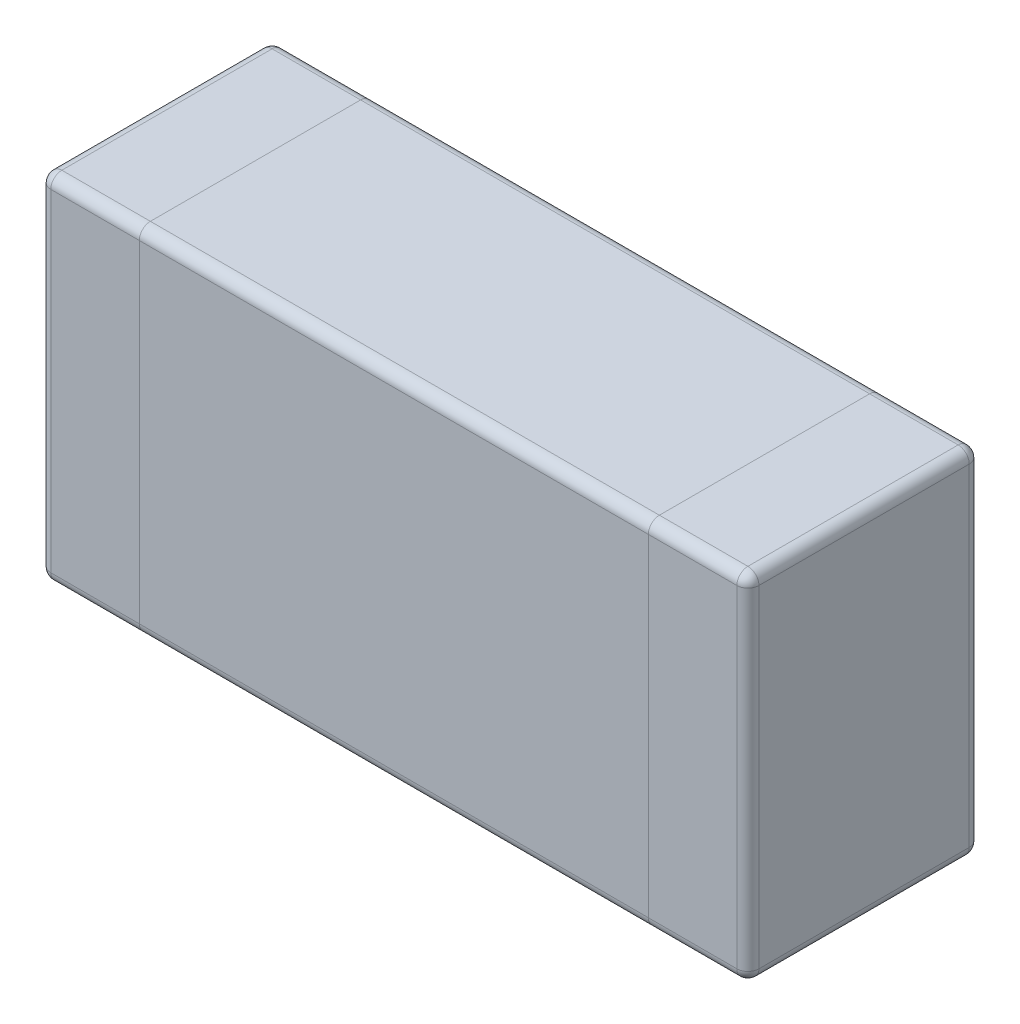
ISO-10303-21;
HEADER;
FILE_DESCRIPTION(('STEP AP214'),'2;1');
FILE_NAME('part.step','',(''),(''),'','','');
FILE_SCHEMA(('AUTOMOTIVE_DESIGN { 1 0 10303 214 1 1 1 1 }'));
ENDSEC;
DATA;
#1=APPLICATION_CONTEXT('core data for automotive mechanical design processes');
#2=APPLICATION_PROTOCOL_DEFINITION('international standard','automotive_design',2000,#1);
#3=PRODUCT_CONTEXT('',#1,'mechanical');
#4=PRODUCT('Part','Part','',(#3));
#5=PRODUCT_RELATED_PRODUCT_CATEGORY('part','',(#4));
#6=PRODUCT_DEFINITION_FORMATION('','',#4);
#7=PRODUCT_DEFINITION_CONTEXT('part definition',#1,'design');
#8=PRODUCT_DEFINITION('design','',#6,#7);
#9=PRODUCT_DEFINITION_SHAPE('','',#8);
#10=(LENGTH_UNIT() NAMED_UNIT(*) SI_UNIT(.MILLI.,.METRE.));
#11=(NAMED_UNIT(*) PLANE_ANGLE_UNIT() SI_UNIT($,.RADIAN.));
#12=(NAMED_UNIT(*) SI_UNIT($,.STERADIAN.) SOLID_ANGLE_UNIT());
#13=UNCERTAINTY_MEASURE_WITH_UNIT(LENGTH_MEASURE(1.E-05),#10,'distance_accuracy_value','');
#14=(GEOMETRIC_REPRESENTATION_CONTEXT(3) GLOBAL_UNCERTAINTY_ASSIGNED_CONTEXT((#13)) GLOBAL_UNIT_ASSIGNED_CONTEXT((#10,
#11,#12)) REPRESENTATION_CONTEXT('',''));
#15=CARTESIAN_POINT('',(0.,0.,0.));
#16=DIRECTION('',(0.,0.,1.));
#17=DIRECTION('',(1.,0.,0.));
#18=AXIS2_PLACEMENT_3D('',#15,#16,#17);
#19=CARTESIAN_POINT('',(1.55,0.749999999999718,1.0500000000002));
#20=DIRECTION('',(0.,2.68882138776405E-13,-1.));
#21=DIRECTION('',(0.,1.,2.68882138776405E-13));
#22=AXIS2_PLACEMENT_3D('',#19,#20,#21);
#23=CYLINDRICAL_SURFACE('',#22,0.05);
#24=CARTESIAN_POINT('',(1.55,0.749999999999731,1.0000000000002));
#25=DIRECTION('',(0.,2.68882138776405E-13,-1.));
#26=DIRECTION('',(0.,-1.,-2.68882138776405E-13));
#27=AXIS2_PLACEMENT_3D('',#24,#25,#26);
#28=CIRCLE('',#27,0.05);
#29=CARTESIAN_POINT('',(1.55,0.799999999999731,1.00000000000021));
#30=VERTEX_POINT('',#29);
#31=CARTESIAN_POINT('',(1.6,0.749999999999731,1.0000000000002));
#32=VERTEX_POINT('',#31);
#33=EDGE_CURVE('E25',#30,#32,#28,.T.);
#34=ORIENTED_EDGE('',*,*,#33,.T.);
#35=DIRECTION('',(0.,-2.68736422004423E-13,1.));
#36=VECTOR('',#35,1.);
#37=CARTESIAN_POINT('',(1.6,0.749999999999718,1.0500000000002));
#38=LINE('',#37,#36);
#39=CARTESIAN_POINT('',(1.6,0.749999999999987,0.0500000000002015));
#40=VERTEX_POINT('',#39);
#41=EDGE_CURVE('E291',#40,#32,#38,.T.);
#42=ORIENTED_EDGE('',*,*,#41,.F.);
#43=CARTESIAN_POINT('',(1.55,0.749999999999987,0.0500000000002015));
#44=DIRECTION('',(0.,-2.68746613504845E-13,1.));
#45=DIRECTION('',(0.,1.,2.68746613504845E-13));
#46=AXIS2_PLACEMENT_3D('',#43,#44,#45);
#47=CIRCLE('',#46,0.05);
#48=CARTESIAN_POINT('',(1.55,0.799999999999987,0.0500000000002149));
#49=VERTEX_POINT('',#48);
#50=EDGE_CURVE('E11',#40,#49,#47,.T.);
#51=ORIENTED_EDGE('',*,*,#50,.T.);
#52=DIRECTION('',(0.,2.68736422004423E-13,-1.));
#53=VECTOR('',#52,1.);
#54=CARTESIAN_POINT('',(1.55,0.799999999999718,1.05000000000021));
#55=LINE('',#54,#53);
#56=EDGE_CURVE('E287',#30,#49,#55,.T.);
#57=ORIENTED_EDGE('',*,*,#56,.F.);
#58=EDGE_LOOP('',(#34,#42,#51,#57));
#59=FACE_BOUND('',#58,.T.);
#60=ADVANCED_FACE('F17',(#59),#23,.T.);
#61=CARTESIAN_POINT('',(1.55,0.749999999999987,0.0500000000002016));
#62=DIRECTION('',(0.,-2.68736422004423E-13,1.));
#63=DIRECTION('',(1.,0.,0.));
#64=AXIS2_PLACEMENT_3D('',#61,#62,#63);
#65=SPHERICAL_SURFACE('',#64,0.05);
#66=CARTESIAN_POINT('',(1.55,0.749999999999987,0.0500000000002015));
#67=DIRECTION('',(0.,1.,2.68736422004423E-13));
#68=DIRECTION('',(-1.,0.,0.));
#69=AXIS2_PLACEMENT_3D('',#66,#67,#68);
#70=CIRCLE('',#69,0.05);
#71=CARTESIAN_POINT('',(1.55,0.75,2.01552316503317E-13));
#72=VERTEX_POINT('',#71);
#73=EDGE_CURVE('E336',#40,#72,#70,.T.);
#74=ORIENTED_EDGE('',*,*,#73,.T.);
#75=CARTESIAN_POINT('',(1.55,0.749999999999987,0.0500000000002016));
#76=DIRECTION('',(1.,0.,0.));
#77=DIRECTION('',(0.,1.,2.68746613504845E-13));
#78=AXIS2_PLACEMENT_3D('',#75,#76,#77);
#79=CIRCLE('',#78,0.05);
#80=EDGE_CURVE('E424',#72,#49,#79,.T.);
#81=ORIENTED_EDGE('',*,*,#80,.T.);
#82=ORIENTED_EDGE('',*,*,#50,.F.);
#83=EDGE_LOOP('',(#74,#81,#82));
#84=FACE_BOUND('',#83,.T.);
#85=ADVANCED_FACE('F533',(#84),#65,.T.);
#86=CARTESIAN_POINT('',(1.55,0.749999999999731,1.0000000000002));
#87=DIRECTION('',(0.,-2.68736422004423E-13,1.));
#88=DIRECTION('',(1.,0.,0.));
#89=AXIS2_PLACEMENT_3D('',#86,#87,#88);
#90=SPHERICAL_SURFACE('',#89,0.05);
#91=CARTESIAN_POINT('',(1.55,0.749999999999731,1.0000000000002));
#92=DIRECTION('',(1.,0.,0.));
#93=DIRECTION('',(0.,-2.68882138776406E-13,1.));
#94=AXIS2_PLACEMENT_3D('',#91,#92,#93);
#95=CIRCLE('',#94,0.05);
#96=CARTESIAN_POINT('',(1.55,0.749999999999718,1.0500000000002));
#97=VERTEX_POINT('',#96);
#98=EDGE_CURVE('E303',#30,#97,#95,.T.);
#99=ORIENTED_EDGE('',*,*,#98,.T.);
#100=CARTESIAN_POINT('',(1.55,0.749999999999731,1.0000000000002));
#101=DIRECTION('',(0.,1.,2.68736422004423E-13));
#102=DIRECTION('',(-1.,0.,0.));
#103=AXIS2_PLACEMENT_3D('',#100,#101,#102);
#104=CIRCLE('',#103,0.05);
#105=EDGE_CURVE('E332',#97,#32,#104,.T.);
#106=ORIENTED_EDGE('',*,*,#105,.T.);
#107=ORIENTED_EDGE('',*,*,#33,.F.);
#108=EDGE_LOOP('',(#99,#106,#107));
#109=FACE_BOUND('',#108,.T.);
#110=ADVANCED_FACE('F518',(#109),#90,.T.);
#111=CARTESIAN_POINT('',(1.55,-0.800000000000014,0.0499999999997849));
#112=DIRECTION('',(0.,-1.,-2.68736422004423E-13));
#113=DIRECTION('',(1.,0.,0.));
#114=AXIS2_PLACEMENT_3D('',#111,#112,#113);
#115=CYLINDRICAL_SURFACE('',#114,0.05);
#116=CARTESIAN_POINT('',(1.55,-0.750000000000014,0.0499999999997985));
#117=DIRECTION('',(0.,1.,2.68736422004423E-13));
#118=DIRECTION('',(1.,0.,0.));
#119=AXIS2_PLACEMENT_3D('',#116,#117,#118);
#120=CIRCLE('',#119,0.05);
#121=CARTESIAN_POINT('',(1.6,-0.750000000000014,0.0499999999997984));
#122=VERTEX_POINT('',#121);
#123=CARTESIAN_POINT('',(1.55,-0.75,-2.01552316503317E-13));
#124=VERTEX_POINT('',#123);
#125=EDGE_CURVE('E337',#122,#124,#120,.T.);
#126=ORIENTED_EDGE('',*,*,#125,.T.);
#127=DIRECTION('',(0.,-1.,-2.68736422004423E-13));
#128=VECTOR('',#127,1.);
#129=CARTESIAN_POINT('',(1.55,-0.8,-2.14989137603538E-13));
#130=LINE('',#129,#128);
#131=EDGE_CURVE('E226',#72,#124,#130,.T.);
#132=ORIENTED_EDGE('',*,*,#131,.F.);
#133=ORIENTED_EDGE('',*,*,#73,.F.);
#134=DIRECTION('',(0.,1.,2.68736422004423E-13));
#135=VECTOR('',#134,1.);
#136=CARTESIAN_POINT('',(1.6,0.799999999999987,0.0500000000002149));
#137=LINE('',#136,#135);
#138=EDGE_CURVE('E399',#122,#40,#137,.T.);
#139=ORIENTED_EDGE('',*,*,#138,.F.);
#140=EDGE_LOOP('',(#126,#132,#133,#139));
#141=FACE_BOUND('',#140,.T.);
#142=ADVANCED_FACE('F529',(#141),#115,.T.);
#143=CARTESIAN_POINT('',(-1.6,0.749999999999987,0.0500000000002015));
#144=DIRECTION('',(1.,0.,0.));
#145=DIRECTION('',(0.,1.,2.68746613504845E-13));
#146=AXIS2_PLACEMENT_3D('',#143,#144,#145);
#147=CYLINDRICAL_SURFACE('',#146,0.05);
#148=CARTESIAN_POINT('',(-1.15,0.749999999999987,0.0500000000002015));
#149=DIRECTION('',(-1.,0.,0.));
#150=DIRECTION('',(0.,1.,2.68746613504845E-13));
#151=AXIS2_PLACEMENT_3D('',#148,#149,#150);
#152=CIRCLE('',#151,0.05);
#153=CARTESIAN_POINT('',(-1.15,0.799999999999987,0.0500000000002149));
#154=VERTEX_POINT('',#153);
#155=CARTESIAN_POINT('',(-1.15,0.75,2.01552316503317E-13));
#156=VERTEX_POINT('',#155);
#157=EDGE_CURVE('E405',#154,#156,#152,.T.);
#158=ORIENTED_EDGE('',*,*,#157,.F.);
#159=DIRECTION('',(-1.,0.,0.));
#160=VECTOR('',#159,1.);
#161=CARTESIAN_POINT('',(-1.6,0.799999999999987,0.0500000000002149));
#162=LINE('',#161,#160);
#163=CARTESIAN_POINT('',(1.15,0.799999999999987,0.0500000000002149));
#164=VERTEX_POINT('',#163);
#165=EDGE_CURVE('E431',#164,#154,#162,.T.);
#166=ORIENTED_EDGE('',*,*,#165,.F.);
#167=CARTESIAN_POINT('',(1.15,0.749999999999987,0.0500000000002015));
#168=DIRECTION('',(1.,0.,0.));
#169=DIRECTION('',(0.,-1.,-2.68746613504845E-13));
#170=AXIS2_PLACEMENT_3D('',#167,#168,#169);
#171=CIRCLE('',#170,0.05);
#172=CARTESIAN_POINT('',(1.15,0.75,2.01552316503317E-13));
#173=VERTEX_POINT('',#172);
#174=EDGE_CURVE('E413',#173,#164,#171,.T.);
#175=ORIENTED_EDGE('',*,*,#174,.F.);
#176=DIRECTION('',(1.,0.,0.));
#177=VECTOR('',#176,1.);
#178=CARTESIAN_POINT('',(1.6,0.75,2.01552316503317E-13));
#179=LINE('',#178,#177);
#180=EDGE_CURVE('E467',#156,#173,#179,.T.);
#181=ORIENTED_EDGE('',*,*,#180,.F.);
#182=EDGE_LOOP('',(#158,#166,#175,#181));
#183=FACE_BOUND('',#182,.T.);
#184=ADVANCED_FACE('F576',(#183),#147,.T.);
#185=CARTESIAN_POINT('',(1.6,0.749999999999731,1.0000000000002));
#186=DIRECTION('',(-1.,0.,0.));
#187=DIRECTION('',(0.,-1.,-2.68882138776405E-13));
#188=AXIS2_PLACEMENT_3D('',#185,#186,#187);
#189=CYLINDRICAL_SURFACE('',#188,0.05);
#190=CARTESIAN_POINT('',(-1.15,0.749999999999731,1.0000000000002));
#191=DIRECTION('',(-1.,0.,0.));
#192=DIRECTION('',(0.,1.,2.68882138776405E-13));
#193=AXIS2_PLACEMENT_3D('',#190,#191,#192);
#194=CIRCLE('',#193,0.05);
#195=CARTESIAN_POINT('',(-1.15,0.749999999999718,1.0500000000002));
#196=VERTEX_POINT('',#195);
#197=CARTESIAN_POINT('',(-1.15,0.799999999999731,1.00000000000021));
#198=VERTEX_POINT('',#197);
#199=EDGE_CURVE('E217',#196,#198,#194,.T.);
#200=ORIENTED_EDGE('',*,*,#199,.F.);
#201=DIRECTION('',(-1.,0.,0.));
#202=VECTOR('',#201,1.);
#203=CARTESIAN_POINT('',(1.6,0.749999999999718,1.0500000000002));
#204=LINE('',#203,#202);
#205=CARTESIAN_POINT('',(1.15,0.749999999999718,1.0500000000002));
#206=VERTEX_POINT('',#205);
#207=EDGE_CURVE('E202',#206,#196,#204,.T.);
#208=ORIENTED_EDGE('',*,*,#207,.F.);
#209=CARTESIAN_POINT('',(1.15,0.749999999999731,1.0000000000002));
#210=DIRECTION('',(1.,0.,0.));
#211=DIRECTION('',(0.,-1.,-2.68882138776405E-13));
#212=AXIS2_PLACEMENT_3D('',#209,#210,#211);
#213=CIRCLE('',#212,0.05);
#214=CARTESIAN_POINT('',(1.15,0.799999999999731,1.00000000000021));
#215=VERTEX_POINT('',#214);
#216=EDGE_CURVE('E308',#215,#206,#213,.T.);
#217=ORIENTED_EDGE('',*,*,#216,.F.);
#218=DIRECTION('',(1.,0.,0.));
#219=VECTOR('',#218,1.);
#220=CARTESIAN_POINT('',(-1.6,0.799999999999731,1.00000000000021));
#221=LINE('',#220,#219);
#222=EDGE_CURVE('E220',#198,#215,#221,.T.);
#223=ORIENTED_EDGE('',*,*,#222,.F.);
#224=EDGE_LOOP('',(#200,#208,#217,#223));
#225=FACE_BOUND('',#224,.T.);
#226=ADVANCED_FACE('F219',(#225),#189,.T.);
#227=CARTESIAN_POINT('',(1.55,0.799999999999731,1.00000000000021));
#228=DIRECTION('',(0.,1.,2.68736422004423E-13));
#229=DIRECTION('',(-1.,0.,0.));
#230=AXIS2_PLACEMENT_3D('',#227,#228,#229);
#231=CYLINDRICAL_SURFACE('',#230,0.05);
#232=CARTESIAN_POINT('',(1.55,-0.750000000000269,0.999999999999799));
#233=DIRECTION('',(0.,1.,2.71050543121376E-13));
#234=DIRECTION('',(0.,2.71050543121376E-13,-1.));
#235=AXIS2_PLACEMENT_3D('',#232,#233,#234);
#236=CIRCLE('',#235,0.05);
#237=CARTESIAN_POINT('',(1.55,-0.750000000000283,1.0499999999998));
#238=VERTEX_POINT('',#237);
#239=CARTESIAN_POINT('',(1.6,-0.750000000000269,0.999999999999799));
#240=VERTEX_POINT('',#239);
#241=EDGE_CURVE('E503',#238,#240,#236,.T.);
#242=ORIENTED_EDGE('',*,*,#241,.T.);
#243=DIRECTION('',(0.,-1.,-2.68736422004423E-13));
#244=VECTOR('',#243,1.);
#245=CARTESIAN_POINT('',(1.6,-0.800000000000269,0.999999999999786));
#246=LINE('',#245,#244);
#247=EDGE_CURVE('E400',#32,#240,#246,.T.);
#248=ORIENTED_EDGE('',*,*,#247,.F.);
#249=ORIENTED_EDGE('',*,*,#105,.F.);
#250=DIRECTION('',(0.,1.,2.68736422004423E-13));
#251=VECTOR('',#250,1.);
#252=CARTESIAN_POINT('',(1.55,0.799999999999718,1.05000000000021));
#253=LINE('',#252,#251);
#254=EDGE_CURVE('E282',#238,#97,#253,.T.);
#255=ORIENTED_EDGE('',*,*,#254,.F.);
#256=EDGE_LOOP('',(#242,#248,#249,#255));
#257=FACE_BOUND('',#256,.T.);
#258=ADVANCED_FACE('F522',(#257),#231,.T.);
#259=CARTESIAN_POINT('',(1.55,-0.750000000000014,0.0499999999997985));
#260=DIRECTION('',(0.,-2.68736422004423E-13,1.));
#261=DIRECTION('',(1.,0.,0.));
#262=AXIS2_PLACEMENT_3D('',#259,#260,#261);
#263=SPHERICAL_SURFACE('',#262,0.05);
#264=CARTESIAN_POINT('',(1.55,-0.750000000000014,0.0499999999997984));
#265=DIRECTION('',(0.,2.68746613504845E-13,-1.));
#266=DIRECTION('',(0.,1.,2.68746613504845E-13));
#267=AXIS2_PLACEMENT_3D('',#264,#265,#266);
#268=CIRCLE('',#267,0.05);
#269=CARTESIAN_POINT('',(1.55,-0.800000000000014,0.0499999999997849));
#270=VERTEX_POINT('',#269);
#271=EDGE_CURVE('E491',#122,#270,#268,.T.);
#272=ORIENTED_EDGE('',*,*,#271,.T.);
#273=CARTESIAN_POINT('',(1.55,-0.750000000000014,0.0499999999997984));
#274=DIRECTION('',(1.,0.,0.));
#275=DIRECTION('',(0.,1.,2.68746613504845E-13));
#276=AXIS2_PLACEMENT_3D('',#273,#274,#275);
#277=CIRCLE('',#276,0.05);
#278=EDGE_CURVE('E370',#270,#124,#277,.T.);
#279=ORIENTED_EDGE('',*,*,#278,.T.);
#280=ORIENTED_EDGE('',*,*,#125,.F.);
#281=EDGE_LOOP('',(#272,#279,#280));
#282=FACE_BOUND('',#281,.T.);
#283=ADVANCED_FACE('F561',(#282),#263,.T.);
#284=CARTESIAN_POINT('',(-1.55,0.749999999999987,0.0500000000002016));
#285=DIRECTION('',(0.,-2.68736422004423E-13,1.));
#286=DIRECTION('',(1.,0.,0.));
#287=AXIS2_PLACEMENT_3D('',#284,#285,#286);
#288=SPHERICAL_SURFACE('',#287,0.05);
#289=CARTESIAN_POINT('',(-1.55,0.749999999999987,0.0500000000002016));
#290=DIRECTION('',(0.,1.,2.68736422004423E-13));
#291=DIRECTION('',(-1.,0.,0.));
#292=AXIS2_PLACEMENT_3D('',#289,#290,#291);
#293=CIRCLE('',#292,0.05);
#294=CARTESIAN_POINT('',(-1.55,0.75,2.01552316503317E-13));
#295=VERTEX_POINT('',#294);
#296=CARTESIAN_POINT('',(-1.6,0.749999999999987,0.0500000000002015));
#297=VERTEX_POINT('',#296);
#298=EDGE_CURVE('E38',#295,#297,#293,.T.);
#299=ORIENTED_EDGE('',*,*,#298,.T.);
#300=CARTESIAN_POINT('',(-1.55,0.749999999999987,0.0500000000002015));
#301=DIRECTION('',(0.,2.68746613504845E-13,-1.));
#302=DIRECTION('',(0.,1.,2.68746613504845E-13));
#303=AXIS2_PLACEMENT_3D('',#300,#301,#302);
#304=CIRCLE('',#303,0.05);
#305=CARTESIAN_POINT('',(-1.55,0.799999999999987,0.0500000000002149));
#306=VERTEX_POINT('',#305);
#307=EDGE_CURVE('E494',#297,#306,#304,.T.);
#308=ORIENTED_EDGE('',*,*,#307,.T.);
#309=CARTESIAN_POINT('',(-1.55,0.749999999999987,0.0500000000002015));
#310=DIRECTION('',(1.,0.,0.));
#311=DIRECTION('',(0.,-1.,-2.68746613504845E-13));
#312=AXIS2_PLACEMENT_3D('',#309,#310,#311);
#313=CIRCLE('',#312,0.05);
#314=EDGE_CURVE('E409',#295,#306,#313,.T.);
#315=ORIENTED_EDGE('',*,*,#314,.F.);
#316=EDGE_LOOP('',(#299,#308,#315));
#317=FACE_BOUND('',#316,.T.);
#318=ADVANCED_FACE('F675',(#317),#288,.T.);
#319=CARTESIAN_POINT('',(-1.55,0.749999999999731,1.0000000000002));
#320=DIRECTION('',(0.,-2.68736422004423E-13,1.));
#321=DIRECTION('',(1.,0.,0.));
#322=AXIS2_PLACEMENT_3D('',#319,#320,#321);
#323=SPHERICAL_SURFACE('',#322,0.05);
#324=CARTESIAN_POINT('',(-1.55,0.749999999999731,1.0000000000002));
#325=DIRECTION('',(0.,-2.68882138776405E-13,1.));
#326=DIRECTION('',(0.,-1.,-2.68882138776405E-13));
#327=AXIS2_PLACEMENT_3D('',#324,#325,#326);
#328=CIRCLE('',#327,0.05);
#329=CARTESIAN_POINT('',(-1.55,0.799999999999731,1.00000000000021));
#330=VERTEX_POINT('',#329);
#331=CARTESIAN_POINT('',(-1.6,0.749999999999732,1.0000000000002));
#332=VERTEX_POINT('',#331);
#333=EDGE_CURVE('E49',#330,#332,#328,.T.);
#334=ORIENTED_EDGE('',*,*,#333,.T.);
#335=CARTESIAN_POINT('',(-1.55,0.749999999999732,1.0000000000002));
#336=DIRECTION('',(0.,1.,2.71050543121376E-13));
#337=DIRECTION('',(0.,-2.71050543121376E-13,1.));
#338=AXIS2_PLACEMENT_3D('',#335,#336,#337);
#339=CIRCLE('',#338,0.05);
#340=CARTESIAN_POINT('',(-1.55,0.749999999999718,1.0500000000002));
#341=VERTEX_POINT('',#340);
#342=EDGE_CURVE('E486',#332,#341,#339,.T.);
#343=ORIENTED_EDGE('',*,*,#342,.T.);
#344=CARTESIAN_POINT('',(-1.55,0.749999999999731,1.0000000000002));
#345=DIRECTION('',(1.,0.,0.));
#346=DIRECTION('',(0.,-1.,-2.68882138776405E-13));
#347=AXIS2_PLACEMENT_3D('',#344,#345,#346);
#348=CIRCLE('',#347,0.05);
#349=EDGE_CURVE('E232',#330,#341,#348,.T.);
#350=ORIENTED_EDGE('',*,*,#349,.F.);
#351=EDGE_LOOP('',(#334,#343,#350));
#352=FACE_BOUND('',#351,.T.);
#353=ADVANCED_FACE('F585',(#352),#323,.T.);
#354=CARTESIAN_POINT('',(1.55,-0.750000000000269,0.999999999999799));
#355=DIRECTION('',(0.,-2.68736422004423E-13,1.));
#356=DIRECTION('',(1.,0.,0.));
#357=AXIS2_PLACEMENT_3D('',#354,#355,#356);
#358=SPHERICAL_SURFACE('',#357,0.05);
#359=CARTESIAN_POINT('',(1.55,-0.750000000000269,0.999999999999799));
#360=DIRECTION('',(1.,0.,0.));
#361=DIRECTION('',(0.,1.,2.68882138776405E-13));
#362=AXIS2_PLACEMENT_3D('',#359,#360,#361);
#363=CIRCLE('',#362,0.05);
#364=CARTESIAN_POINT('',(1.55,-0.800000000000269,0.999999999999786));
#365=VERTEX_POINT('',#364);
#366=EDGE_CURVE('E286',#238,#365,#363,.T.);
#367=ORIENTED_EDGE('',*,*,#366,.T.);
#368=CARTESIAN_POINT('',(1.55,-0.750000000000269,0.999999999999799));
#369=DIRECTION('',(0.,-2.68882138776405E-13,1.));
#370=DIRECTION('',(0.,-1.,-2.68882138776405E-13));
#371=AXIS2_PLACEMENT_3D('',#368,#369,#370);
#372=CIRCLE('',#371,0.05);
#373=EDGE_CURVE('E487',#365,#240,#372,.T.);
#374=ORIENTED_EDGE('',*,*,#373,.T.);
#375=ORIENTED_EDGE('',*,*,#241,.F.);
#376=EDGE_LOOP('',(#367,#374,#375));
#377=FACE_BOUND('',#376,.T.);
#378=ADVANCED_FACE('F554',(#377),#358,.T.);
#379=CARTESIAN_POINT('',(1.55,-0.750000000000283,1.0499999999998));
#380=DIRECTION('',(0.,2.68882138776405E-13,-1.));
#381=DIRECTION('',(0.,1.,2.68882138776405E-13));
#382=AXIS2_PLACEMENT_3D('',#379,#380,#381);
#383=CYLINDRICAL_SURFACE('',#382,0.05);
#384=ORIENTED_EDGE('',*,*,#373,.F.);
#385=DIRECTION('',(0.,-2.68736422004423E-13,1.));
#386=VECTOR('',#385,1.);
#387=CARTESIAN_POINT('',(1.55,-0.800000000000282,1.04999999999979));
#388=LINE('',#387,#386);
#389=EDGE_CURVE('E341',#270,#365,#388,.T.);
#390=ORIENTED_EDGE('',*,*,#389,.F.);
#391=ORIENTED_EDGE('',*,*,#271,.F.);
#392=DIRECTION('',(0.,2.68736422004423E-13,-1.));
#393=VECTOR('',#392,1.);
#394=CARTESIAN_POINT('',(1.6,-0.750000000000283,1.0499999999998));
#395=LINE('',#394,#393);
#396=EDGE_CURVE('E396',#240,#122,#395,.T.);
#397=ORIENTED_EDGE('',*,*,#396,.F.);
#398=EDGE_LOOP('',(#384,#390,#391,#397));
#399=FACE_BOUND('',#398,.T.);
#400=ADVANCED_FACE('F558',(#399),#383,.T.);
#401=CARTESIAN_POINT('',(-1.6,-0.750000000000014,0.0499999999997984));
#402=DIRECTION('',(-1.,0.,0.));
#403=DIRECTION('',(0.,-1.,-2.68746613504845E-13));
#404=AXIS2_PLACEMENT_3D('',#401,#402,#403);
#405=CYLINDRICAL_SURFACE('',#404,0.05);
#406=CARTESIAN_POINT('',(-1.15,-0.750000000000014,0.0499999999997984));
#407=DIRECTION('',(-1.,0.,0.));
#408=DIRECTION('',(0.,1.,2.68746613504845E-13));
#409=AXIS2_PLACEMENT_3D('',#406,#407,#408);
#410=CIRCLE('',#409,0.05);
#411=CARTESIAN_POINT('',(-1.15,-0.75,-2.01552316503317E-13));
#412=VERTEX_POINT('',#411);
#413=CARTESIAN_POINT('',(-1.15,-0.800000000000014,0.0499999999997849));
#414=VERTEX_POINT('',#413);
#415=EDGE_CURVE('E349',#412,#414,#410,.T.);
#416=ORIENTED_EDGE('',*,*,#415,.F.);
#417=DIRECTION('',(-1.,0.,0.));
#418=VECTOR('',#417,1.);
#419=CARTESIAN_POINT('',(-1.6,-0.75,-2.01552316503317E-13));
#420=LINE('',#419,#418);
#421=CARTESIAN_POINT('',(1.15,-0.75,-2.01552316503317E-13));
#422=VERTEX_POINT('',#421);
#423=EDGE_CURVE('E468',#422,#412,#420,.T.);
#424=ORIENTED_EDGE('',*,*,#423,.F.);
#425=CARTESIAN_POINT('',(1.15,-0.750000000000014,0.0499999999997984));
#426=DIRECTION('',(1.,0.,0.));
#427=DIRECTION('',(0.,-1.,-2.68746613504845E-13));
#428=AXIS2_PLACEMENT_3D('',#425,#426,#427);
#429=CIRCLE('',#428,0.05);
#430=CARTESIAN_POINT('',(1.15,-0.800000000000014,0.0499999999997849));
#431=VERTEX_POINT('',#430);
#432=EDGE_CURVE('E357',#431,#422,#429,.T.);
#433=ORIENTED_EDGE('',*,*,#432,.F.);
#434=DIRECTION('',(1.,0.,0.));
#435=VECTOR('',#434,1.);
#436=CARTESIAN_POINT('',(1.6,-0.800000000000014,0.0499999999997849));
#437=LINE('',#436,#435);
#438=EDGE_CURVE('E214',#414,#431,#437,.T.);
#439=ORIENTED_EDGE('',*,*,#438,.F.);
#440=EDGE_LOOP('',(#416,#424,#433,#439));
#441=FACE_BOUND('',#440,.T.);
#442=ADVANCED_FACE('F702',(#441),#405,.T.);
#443=CARTESIAN_POINT('',(-1.55,-0.800000000000014,0.0499999999997849));
#444=DIRECTION('',(0.,1.,2.68736422004423E-13));
#445=DIRECTION('',(-1.,0.,0.));
#446=AXIS2_PLACEMENT_3D('',#443,#444,#445);
#447=CYLINDRICAL_SURFACE('',#446,0.05);
#448=CARTESIAN_POINT('',(-1.55,-0.750000000000014,0.0499999999997984));
#449=DIRECTION('',(0.,1.,2.68736422004423E-13));
#450=DIRECTION('',(1.,0.,0.));
#451=AXIS2_PLACEMENT_3D('',#448,#449,#450);
#452=CIRCLE('',#451,0.05);
#453=CARTESIAN_POINT('',(-1.55,-0.75,-2.01552316503317E-13));
#454=VERTEX_POINT('',#453);
#455=CARTESIAN_POINT('',(-1.6,-0.750000000000014,0.0499999999997984));
#456=VERTEX_POINT('',#455);
#457=EDGE_CURVE('E483',#454,#456,#452,.T.);
#458=ORIENTED_EDGE('',*,*,#457,.T.);
#459=DIRECTION('',(0.,-1.,-2.68736422004423E-13));
#460=VECTOR('',#459,1.);
#461=CARTESIAN_POINT('',(-1.6,-0.800000000000014,0.0499999999997849));
#462=LINE('',#461,#460);
#463=EDGE_CURVE('E456',#297,#456,#462,.T.);
#464=ORIENTED_EDGE('',*,*,#463,.F.);
#465=ORIENTED_EDGE('',*,*,#298,.F.);
#466=DIRECTION('',(0.,1.,2.68736422004423E-13));
#467=VECTOR('',#466,1.);
#468=CARTESIAN_POINT('',(-1.55,0.8,2.14989137603538E-13));
#469=LINE('',#468,#467);
#470=EDGE_CURVE('E277',#454,#295,#469,.T.);
#471=ORIENTED_EDGE('',*,*,#470,.F.);
#472=EDGE_LOOP('',(#458,#464,#465,#471));
#473=FACE_BOUND('',#472,.T.);
#474=ADVANCED_FACE('F710',(#473),#447,.T.);
#475=CARTESIAN_POINT('',(-1.55,0.749999999999718,1.0500000000002));
#476=DIRECTION('',(0.,2.68882138776405E-13,-1.));
#477=DIRECTION('',(0.,1.,2.68882138776405E-13));
#478=AXIS2_PLACEMENT_3D('',#475,#476,#477);
#479=CYLINDRICAL_SURFACE('',#478,0.05);
#480=ORIENTED_EDGE('',*,*,#307,.F.);
#481=DIRECTION('',(0.,2.68736422004423E-13,-1.));
#482=VECTOR('',#481,1.);
#483=CARTESIAN_POINT('',(-1.6,0.749999999999718,1.0500000000002));
#484=LINE('',#483,#482);
#485=EDGE_CURVE('E452',#332,#297,#484,.T.);
#486=ORIENTED_EDGE('',*,*,#485,.F.);
#487=ORIENTED_EDGE('',*,*,#333,.F.);
#488=DIRECTION('',(0.,-2.68736422004423E-13,1.));
#489=VECTOR('',#488,1.);
#490=CARTESIAN_POINT('',(-1.55,0.799999999999718,1.05000000000021));
#491=LINE('',#490,#489);
#492=EDGE_CURVE('E385',#306,#330,#491,.T.);
#493=ORIENTED_EDGE('',*,*,#492,.F.);
#494=EDGE_LOOP('',(#480,#486,#487,#493));
#495=FACE_BOUND('',#494,.T.);
#496=ADVANCED_FACE('F590',(#495),#479,.T.);
#497=CARTESIAN_POINT('',(-1.55,0.799999999999731,1.00000000000021));
#498=DIRECTION('',(0.,-1.,-2.68736422004423E-13));
#499=DIRECTION('',(1.,0.,0.));
#500=AXIS2_PLACEMENT_3D('',#497,#498,#499);
#501=CYLINDRICAL_SURFACE('',#500,0.05);
#502=CARTESIAN_POINT('',(-1.55,-0.750000000000269,0.999999999999799));
#503=DIRECTION('',(0.,1.,2.68736422004423E-13));
#504=DIRECTION('',(1.,0.,0.));
#505=AXIS2_PLACEMENT_3D('',#502,#503,#504);
#506=CIRCLE('',#505,0.05);
#507=CARTESIAN_POINT('',(-1.6,-0.750000000000269,0.999999999999799));
#508=VERTEX_POINT('',#507);
#509=CARTESIAN_POINT('',(-1.55,-0.750000000000283,1.0499999999998));
#510=VERTEX_POINT('',#509);
#511=EDGE_CURVE('E480',#508,#510,#506,.T.);
#512=ORIENTED_EDGE('',*,*,#511,.T.);
#513=DIRECTION('',(0.,-1.,-2.68736422004423E-13));
#514=VECTOR('',#513,1.);
#515=CARTESIAN_POINT('',(-1.55,0.799999999999718,1.05000000000021));
#516=LINE('',#515,#514);
#517=EDGE_CURVE('E237',#341,#510,#516,.T.);
#518=ORIENTED_EDGE('',*,*,#517,.F.);
#519=ORIENTED_EDGE('',*,*,#342,.F.);
#520=DIRECTION('',(0.,1.,2.68736422004423E-13));
#521=VECTOR('',#520,1.);
#522=CARTESIAN_POINT('',(-1.6,-0.800000000000269,0.999999999999786));
#523=LINE('',#522,#521);
#524=EDGE_CURVE('E448',#508,#332,#523,.T.);
#525=ORIENTED_EDGE('',*,*,#524,.F.);
#526=EDGE_LOOP('',(#512,#518,#519,#525));
#527=FACE_BOUND('',#526,.T.);
#528=ADVANCED_FACE('F589',(#527),#501,.T.);
#529=CARTESIAN_POINT('',(1.6,-0.750000000000269,0.999999999999799));
#530=DIRECTION('',(1.,0.,0.));
#531=DIRECTION('',(0.,1.,2.68882138776405E-13));
#532=AXIS2_PLACEMENT_3D('',#529,#530,#531);
#533=CYLINDRICAL_SURFACE('',#532,0.05);
#534=CARTESIAN_POINT('',(-1.15,-0.750000000000269,0.999999999999799));
#535=DIRECTION('',(-1.,0.,0.));
#536=DIRECTION('',(0.,1.,2.68882138776405E-13));
#537=AXIS2_PLACEMENT_3D('',#534,#535,#536);
#538=CIRCLE('',#537,0.05);
#539=CARTESIAN_POINT('',(-1.15,-0.800000000000269,0.999999999999786));
#540=VERTEX_POINT('',#539);
#541=CARTESIAN_POINT('',(-1.15,-0.750000000000283,1.0499999999998));
#542=VERTEX_POINT('',#541);
#543=EDGE_CURVE('E261',#540,#542,#538,.T.);
#544=ORIENTED_EDGE('',*,*,#543,.F.);
#545=DIRECTION('',(-1.,0.,0.));
#546=VECTOR('',#545,1.);
#547=CARTESIAN_POINT('',(-1.6,-0.800000000000269,0.999999999999786));
#548=LINE('',#547,#546);
#549=CARTESIAN_POINT('',(1.15,-0.800000000000269,0.999999999999786));
#550=VERTEX_POINT('',#549);
#551=EDGE_CURVE('E460',#550,#540,#548,.T.);
#552=ORIENTED_EDGE('',*,*,#551,.F.);
#553=CARTESIAN_POINT('',(1.15,-0.750000000000269,0.999999999999799));
#554=DIRECTION('',(1.,0.,0.));
#555=DIRECTION('',(0.,-1.,-2.68882138776405E-13));
#556=AXIS2_PLACEMENT_3D('',#553,#554,#555);
#557=CIRCLE('',#556,0.05);
#558=CARTESIAN_POINT('',(1.15,-0.750000000000283,1.0499999999998));
#559=VERTEX_POINT('',#558);
#560=EDGE_CURVE('E255',#559,#550,#557,.T.);
#561=ORIENTED_EDGE('',*,*,#560,.F.);
#562=DIRECTION('',(1.,0.,0.));
#563=VECTOR('',#562,1.);
#564=CARTESIAN_POINT('',(1.6,-0.750000000000283,1.0499999999998));
#565=LINE('',#564,#563);
#566=EDGE_CURVE('E213',#542,#559,#565,.T.);
#567=ORIENTED_EDGE('',*,*,#566,.F.);
#568=EDGE_LOOP('',(#544,#552,#561,#567));
#569=FACE_BOUND('',#568,.T.);
#570=ADVANCED_FACE('F608',(#569),#533,.T.);
#571=CARTESIAN_POINT('',(-1.55,-0.750000000000014,0.0499999999997985));
#572=DIRECTION('',(0.,-2.68736422004423E-13,1.));
#573=DIRECTION('',(1.,0.,0.));
#574=AXIS2_PLACEMENT_3D('',#571,#572,#573);
#575=SPHERICAL_SURFACE('',#574,0.05);
#576=CARTESIAN_POINT('',(-1.55,-0.750000000000014,0.0499999999997985));
#577=DIRECTION('',(1.,0.,0.));
#578=DIRECTION('',(0.,-1.,-2.70508442035133E-13));
#579=AXIS2_PLACEMENT_3D('',#576,#577,#578);
#580=CIRCLE('',#579,0.05);
#581=CARTESIAN_POINT('',(-1.55,-0.800000000000014,0.0499999999997849));
#582=VERTEX_POINT('',#581);
#583=EDGE_CURVE('E353',#582,#454,#580,.T.);
#584=ORIENTED_EDGE('',*,*,#583,.F.);
#585=CARTESIAN_POINT('',(-1.55,-0.750000000000014,0.0499999999997984));
#586=DIRECTION('',(0.,2.68746613504845E-13,-1.));
#587=DIRECTION('',(0.,1.,2.68746613504845E-13));
#588=AXIS2_PLACEMENT_3D('',#585,#586,#587);
#589=CIRCLE('',#588,0.05);
#590=EDGE_CURVE('E476',#582,#456,#589,.T.);
#591=ORIENTED_EDGE('',*,*,#590,.T.);
#592=ORIENTED_EDGE('',*,*,#457,.F.);
#593=EDGE_LOOP('',(#584,#591,#592));
#594=FACE_BOUND('',#593,.T.);
#595=ADVANCED_FACE('F741',(#594),#575,.T.);
#596=CARTESIAN_POINT('',(-1.55,-0.750000000000269,0.999999999999799));
#597=DIRECTION('',(0.,-2.68736422004423E-13,1.));
#598=DIRECTION('',(1.,0.,0.));
#599=AXIS2_PLACEMENT_3D('',#596,#597,#598);
#600=SPHERICAL_SURFACE('',#599,0.05);
#601=ORIENTED_EDGE('',*,*,#511,.F.);
#602=CARTESIAN_POINT('',(-1.55,-0.750000000000269,0.999999999999799));
#603=DIRECTION('',(0.,-2.68882138776405E-13,1.));
#604=DIRECTION('',(0.,-1.,-2.68882138776405E-13));
#605=AXIS2_PLACEMENT_3D('',#602,#603,#604);
#606=CIRCLE('',#605,0.05);
#607=CARTESIAN_POINT('',(-1.55,-0.800000000000269,0.999999999999786));
#608=VERTEX_POINT('',#607);
#609=EDGE_CURVE('E471',#508,#608,#606,.T.);
#610=ORIENTED_EDGE('',*,*,#609,.T.);
#611=CARTESIAN_POINT('',(-1.55,-0.750000000000269,0.999999999999799));
#612=DIRECTION('',(1.,0.,0.));
#613=DIRECTION('',(0.,2.68882138776405E-13,-1.));
#614=AXIS2_PLACEMENT_3D('',#611,#612,#613);
#615=CIRCLE('',#614,0.05);
#616=EDGE_CURVE('E259',#510,#608,#615,.T.);
#617=ORIENTED_EDGE('',*,*,#616,.F.);
#618=EDGE_LOOP('',(#601,#610,#617));
#619=FACE_BOUND('',#618,.T.);
#620=ADVANCED_FACE('F602',(#619),#600,.T.);
#621=CARTESIAN_POINT('',(-1.55,-0.750000000000283,1.0499999999998));
#622=DIRECTION('',(0.,2.68882138776405E-13,-1.));
#623=DIRECTION('',(0.,1.,2.68882138776405E-13));
#624=AXIS2_PLACEMENT_3D('',#621,#622,#623);
#625=CYLINDRICAL_SURFACE('',#624,0.05);
#626=ORIENTED_EDGE('',*,*,#609,.F.);
#627=DIRECTION('',(0.,-2.68736422004423E-13,1.));
#628=VECTOR('',#627,1.);
#629=CARTESIAN_POINT('',(-1.6,-0.750000000000283,1.0499999999998));
#630=LINE('',#629,#628);
#631=EDGE_CURVE('E430',#456,#508,#630,.T.);
#632=ORIENTED_EDGE('',*,*,#631,.F.);
#633=ORIENTED_EDGE('',*,*,#590,.F.);
#634=DIRECTION('',(0.,2.68736422004423E-13,-1.));
#635=VECTOR('',#634,1.);
#636=CARTESIAN_POINT('',(-1.55,-0.800000000000282,1.04999999999979));
#637=LINE('',#636,#635);
#638=EDGE_CURVE('E249',#608,#582,#637,.T.);
#639=ORIENTED_EDGE('',*,*,#638,.F.);
#640=EDGE_LOOP('',(#626,#632,#633,#639));
#641=FACE_BOUND('',#640,.T.);
#642=ADVANCED_FACE('F597',(#641),#625,.T.);
#643=CARTESIAN_POINT('',(1.6,0.8,2.14989137603538E-13));
#644=DIRECTION('',(0.,2.68736422004423E-13,-1.));
#645=DIRECTION('',(-1.,0.,0.));
#646=AXIS2_PLACEMENT_3D('',#643,#644,#645);
#647=PLANE('',#646);
#648=DIRECTION('',(0.,-1.,-2.68736422004423E-13));
#649=VECTOR('',#648,1.);
#650=CARTESIAN_POINT('',(-1.15,0.8,2.14989137603538E-13));
#651=LINE('',#650,#649);
#652=EDGE_CURVE('E273',#156,#412,#651,.T.);
#653=ORIENTED_EDGE('',*,*,#652,.F.);
#654=ORIENTED_EDGE('',*,*,#180,.T.);
#655=DIRECTION('',(0.,1.,2.68736422004423E-13));
#656=VECTOR('',#655,1.);
#657=CARTESIAN_POINT('',(1.15,0.8,2.14989137603538E-13));
#658=LINE('',#657,#656);
#659=EDGE_CURVE('E380',#422,#173,#658,.T.);
#660=ORIENTED_EDGE('',*,*,#659,.F.);
#661=ORIENTED_EDGE('',*,*,#423,.T.);
#662=EDGE_LOOP('',(#653,#654,#660,#661));
#663=FACE_BOUND('',#662,.T.);
#664=ADVANCED_FACE('F573',(#663),#647,.T.);
#665=CARTESIAN_POINT('',(1.6,0.799999999999718,1.05000000000021));
#666=DIRECTION('',(0.,2.68736422004423E-13,-1.));
#667=DIRECTION('',(-1.,0.,0.));
#668=AXIS2_PLACEMENT_3D('',#665,#666,#667);
#669=PLANE('',#668);
#670=ORIENTED_EDGE('',*,*,#207,.T.);
#671=DIRECTION('',(0.,-1.,-2.68736422004423E-13));
#672=VECTOR('',#671,1.);
#673=CARTESIAN_POINT('',(-1.15,0.799999999999718,1.05000000000021));
#674=LINE('',#673,#672);
#675=EDGE_CURVE('E206',#196,#542,#674,.T.);
#676=ORIENTED_EDGE('',*,*,#675,.T.);
#677=ORIENTED_EDGE('',*,*,#566,.T.);
#678=DIRECTION('',(0.,1.,2.68736422004423E-13));
#679=VECTOR('',#678,1.);
#680=CARTESIAN_POINT('',(1.15,0.799999999999718,1.05000000000021));
#681=LINE('',#680,#679);
#682=EDGE_CURVE('E208',#559,#206,#681,.T.);
#683=ORIENTED_EDGE('',*,*,#682,.T.);
#684=EDGE_LOOP('',(#670,#676,#677,#683));
#685=FACE_BOUND('',#684,.T.);
#686=ADVANCED_FACE('F204',(#685),#669,.F.);
#687=CARTESIAN_POINT('',(-1.6,-0.800000000000282,1.04999999999979));
#688=DIRECTION('',(0.,1.,2.68736422004423E-13));
#689=DIRECTION('',(0.,2.68736422004423E-13,-1.));
#690=AXIS2_PLACEMENT_3D('',#687,#688,#689);
#691=PLANE('',#690);
#692=ORIENTED_EDGE('',*,*,#551,.T.);
#693=DIRECTION('',(0.,2.68736422004423E-13,-1.));
#694=VECTOR('',#693,1.);
#695=CARTESIAN_POINT('',(-1.15,-0.800000000000282,1.04999999999979));
#696=LINE('',#695,#694);
#697=EDGE_CURVE('E254',#540,#414,#696,.T.);
#698=ORIENTED_EDGE('',*,*,#697,.T.);
#699=ORIENTED_EDGE('',*,*,#438,.T.);
#700=DIRECTION('',(0.,-2.68736422004423E-13,1.));
#701=VECTOR('',#700,1.);
#702=CARTESIAN_POINT('',(1.15,-0.800000000000282,1.04999999999979));
#703=LINE('',#702,#701);
#704=EDGE_CURVE('E324',#431,#550,#703,.T.);
#705=ORIENTED_EDGE('',*,*,#704,.T.);
#706=EDGE_LOOP('',(#692,#698,#699,#705));
#707=FACE_BOUND('',#706,.T.);
#708=ADVANCED_FACE('F611',(#707),#691,.F.);
#709=CARTESIAN_POINT('',(-1.6,-0.800000000000282,1.04999999999979));
#710=DIRECTION('',(1.,0.,0.));
#711=DIRECTION('',(0.,1.,0.));
#712=AXIS2_PLACEMENT_3D('',#709,#710,#711);
#713=PLANE('',#712);
#714=ORIENTED_EDGE('',*,*,#631,.T.);
#715=ORIENTED_EDGE('',*,*,#524,.T.);
#716=ORIENTED_EDGE('',*,*,#485,.T.);
#717=ORIENTED_EDGE('',*,*,#463,.T.);
#718=EDGE_LOOP('',(#714,#715,#716,#717));
#719=FACE_BOUND('',#718,.T.);
#720=ADVANCED_FACE('F593',(#719),#713,.F.);
#721=CARTESIAN_POINT('',(-1.6,0.799999999999718,1.05000000000021));
#722=DIRECTION('',(0.,-1.,-2.68736422004423E-13));
#723=DIRECTION('',(0.,2.68736422004423E-13,-1.));
#724=AXIS2_PLACEMENT_3D('',#721,#722,#723);
#725=PLANE('',#724);
#726=ORIENTED_EDGE('',*,*,#165,.T.);
#727=DIRECTION('',(0.,-2.68736422004423E-13,1.));
#728=VECTOR('',#727,1.);
#729=CARTESIAN_POINT('',(-1.15,0.799999999999718,1.05000000000021));
#730=LINE('',#729,#728);
#731=EDGE_CURVE('E389',#154,#198,#730,.T.);
#732=ORIENTED_EDGE('',*,*,#731,.T.);
#733=ORIENTED_EDGE('',*,*,#222,.T.);
#734=DIRECTION('',(0.,2.68736422004423E-13,-1.));
#735=VECTOR('',#734,1.);
#736=CARTESIAN_POINT('',(1.15,0.799999999999718,1.05000000000021));
#737=LINE('',#736,#735);
#738=EDGE_CURVE('E292',#215,#164,#737,.T.);
#739=ORIENTED_EDGE('',*,*,#738,.T.);
#740=EDGE_LOOP('',(#726,#732,#733,#739));
#741=FACE_BOUND('',#740,.T.);
#742=ADVANCED_FACE('F580',(#741),#725,.F.);
#743=CARTESIAN_POINT('',(1.6,-0.800000000000282,1.04999999999979));
#744=DIRECTION('',(-1.,0.,0.));
#745=DIRECTION('',(0.,0.,1.));
#746=AXIS2_PLACEMENT_3D('',#743,#744,#745);
#747=PLANE('',#746);
#748=ORIENTED_EDGE('',*,*,#41,.T.);
#749=ORIENTED_EDGE('',*,*,#247,.T.);
#750=ORIENTED_EDGE('',*,*,#396,.T.);
#751=ORIENTED_EDGE('',*,*,#138,.T.);
#752=EDGE_LOOP('',(#748,#749,#750,#751));
#753=FACE_BOUND('',#752,.T.);
#754=ADVANCED_FACE('F524',(#753),#747,.F.);
#755=CARTESIAN_POINT('',(-1.6,0.799999999999718,1.05000000000021));
#756=DIRECTION('',(0.,-1.,-2.68736422004423E-13));
#757=DIRECTION('',(0.,2.68736422004423E-13,-1.));
#758=AXIS2_PLACEMENT_3D('',#755,#756,#757);
#759=PLANE('',#758);
#760=ORIENTED_EDGE('',*,*,#738,.F.);
#761=DIRECTION('',(1.,0.,0.));
#762=VECTOR('',#761,1.);
#763=CARTESIAN_POINT('',(-1.6,0.799999999999731,1.00000000000021));
#764=LINE('',#763,#762);
#765=EDGE_CURVE('E317',#215,#30,#764,.T.);
#766=ORIENTED_EDGE('',*,*,#765,.T.);
#767=ORIENTED_EDGE('',*,*,#56,.T.);
#768=DIRECTION('',(-1.,0.,0.));
#769=VECTOR('',#768,1.);
#770=CARTESIAN_POINT('',(-1.6,0.799999999999987,0.0500000000002149));
#771=LINE('',#770,#769);
#772=EDGE_CURVE('E417',#49,#164,#771,.T.);
#773=ORIENTED_EDGE('',*,*,#772,.T.);
#774=EDGE_LOOP('',(#760,#766,#767,#773));
#775=FACE_BOUND('',#774,.T.);
#776=ADVANCED_FACE('F541',(#775),#759,.F.);
#777=CARTESIAN_POINT('',(-1.6,0.799999999999718,1.05000000000021));
#778=DIRECTION('',(0.,-1.,-2.68736422004423E-13));
#779=DIRECTION('',(0.,2.68736422004423E-13,-1.));
#780=AXIS2_PLACEMENT_3D('',#777,#778,#779);
#781=PLANE('',#780);
#782=ORIENTED_EDGE('',*,*,#731,.F.);
#783=DIRECTION('',(-1.,0.,0.));
#784=VECTOR('',#783,1.);
#785=CARTESIAN_POINT('',(-1.6,0.799999999999987,0.0500000000002149));
#786=LINE('',#785,#784);
#787=EDGE_CURVE('E307',#154,#306,#786,.T.);
#788=ORIENTED_EDGE('',*,*,#787,.T.);
#789=ORIENTED_EDGE('',*,*,#492,.T.);
#790=DIRECTION('',(1.,0.,0.));
#791=VECTOR('',#790,1.);
#792=CARTESIAN_POINT('',(-1.6,0.799999999999731,1.00000000000021));
#793=LINE('',#792,#791);
#794=EDGE_CURVE('E225',#330,#198,#793,.T.);
#795=ORIENTED_EDGE('',*,*,#794,.T.);
#796=EDGE_LOOP('',(#782,#788,#789,#795));
#797=FACE_BOUND('',#796,.T.);
#798=ADVANCED_FACE('F582',(#797),#781,.F.);
#799=CARTESIAN_POINT('',(-1.6,0.749999999999987,0.0500000000002015));
#800=DIRECTION('',(1.,0.,0.));
#801=DIRECTION('',(0.,1.,2.68746613504845E-13));
#802=AXIS2_PLACEMENT_3D('',#799,#800,#801);
#803=CYLINDRICAL_SURFACE('',#802,0.05);
#804=DIRECTION('',(1.,0.,0.));
#805=VECTOR('',#804,1.);
#806=CARTESIAN_POINT('',(1.6,0.75,2.01552316503317E-13));
#807=LINE('',#806,#805);
#808=EDGE_CURVE('E384',#173,#72,#807,.T.);
#809=ORIENTED_EDGE('',*,*,#808,.F.);
#810=ORIENTED_EDGE('',*,*,#174,.T.);
#811=ORIENTED_EDGE('',*,*,#772,.F.);
#812=ORIENTED_EDGE('',*,*,#80,.F.);
#813=EDGE_LOOP('',(#809,#810,#811,#812));
#814=FACE_BOUND('',#813,.T.);
#815=ADVANCED_FACE('F537',(#814),#803,.T.);
#816=CARTESIAN_POINT('',(-1.6,0.749999999999987,0.0500000000002015));
#817=DIRECTION('',(1.,0.,0.));
#818=DIRECTION('',(0.,1.,2.68746613504845E-13));
#819=AXIS2_PLACEMENT_3D('',#816,#817,#818);
#820=CYLINDRICAL_SURFACE('',#819,0.05);
#821=ORIENTED_EDGE('',*,*,#787,.F.);
#822=ORIENTED_EDGE('',*,*,#157,.T.);
#823=DIRECTION('',(1.,0.,0.));
#824=VECTOR('',#823,1.);
#825=CARTESIAN_POINT('',(1.6,0.75,2.01552316503317E-13));
#826=LINE('',#825,#824);
#827=EDGE_CURVE('E278',#295,#156,#826,.T.);
#828=ORIENTED_EDGE('',*,*,#827,.F.);
#829=ORIENTED_EDGE('',*,*,#314,.T.);
#830=EDGE_LOOP('',(#821,#822,#828,#829));
#831=FACE_BOUND('',#830,.T.);
#832=ADVANCED_FACE('F827',(#831),#820,.T.);
#833=CARTESIAN_POINT('',(1.6,0.749999999999731,1.0000000000002));
#834=DIRECTION('',(-1.,0.,0.));
#835=DIRECTION('',(0.,-1.,-2.68882138776405E-13));
#836=AXIS2_PLACEMENT_3D('',#833,#834,#835);
#837=CYLINDRICAL_SURFACE('',#836,0.05);
#838=ORIENTED_EDGE('',*,*,#765,.F.);
#839=ORIENTED_EDGE('',*,*,#216,.T.);
#840=DIRECTION('',(-1.,0.,0.));
#841=VECTOR('',#840,1.);
#842=CARTESIAN_POINT('',(1.6,0.749999999999718,1.0500000000002));
#843=LINE('',#842,#841);
#844=EDGE_CURVE('E296',#97,#206,#843,.T.);
#845=ORIENTED_EDGE('',*,*,#844,.F.);
#846=ORIENTED_EDGE('',*,*,#98,.F.);
#847=EDGE_LOOP('',(#838,#839,#845,#846));
#848=FACE_BOUND('',#847,.T.);
#849=ADVANCED_FACE('F544',(#848),#837,.T.);
#850=CARTESIAN_POINT('',(1.6,0.749999999999731,1.0000000000002));
#851=DIRECTION('',(-1.,0.,0.));
#852=DIRECTION('',(0.,-1.,-2.68882138776405E-13));
#853=AXIS2_PLACEMENT_3D('',#850,#851,#852);
#854=CYLINDRICAL_SURFACE('',#853,0.05);
#855=DIRECTION('',(-1.,0.,0.));
#856=VECTOR('',#855,1.);
#857=CARTESIAN_POINT('',(1.6,0.749999999999718,1.0500000000002));
#858=LINE('',#857,#856);
#859=EDGE_CURVE('E230',#196,#341,#858,.T.);
#860=ORIENTED_EDGE('',*,*,#859,.F.);
#861=ORIENTED_EDGE('',*,*,#199,.T.);
#862=ORIENTED_EDGE('',*,*,#794,.F.);
#863=ORIENTED_EDGE('',*,*,#349,.T.);
#864=EDGE_LOOP('',(#860,#861,#862,#863));
#865=FACE_BOUND('',#864,.T.);
#866=ADVANCED_FACE('F231',(#865),#854,.T.);
#867=CARTESIAN_POINT('',(1.6,0.8,2.14989137603538E-13));
#868=DIRECTION('',(0.,2.68736422004423E-13,-1.));
#869=DIRECTION('',(-1.,0.,0.));
#870=AXIS2_PLACEMENT_3D('',#867,#868,#869);
#871=PLANE('',#870);
#872=DIRECTION('',(-1.,0.,0.));
#873=VECTOR('',#872,1.);
#874=CARTESIAN_POINT('',(-1.6,-0.75,-2.01552316503317E-13));
#875=LINE('',#874,#873);
#876=EDGE_CURVE('E361',#124,#422,#875,.T.);
#877=ORIENTED_EDGE('',*,*,#876,.T.);
#878=ORIENTED_EDGE('',*,*,#659,.T.);
#879=ORIENTED_EDGE('',*,*,#808,.T.);
#880=ORIENTED_EDGE('',*,*,#131,.T.);
#881=EDGE_LOOP('',(#877,#878,#879,#880));
#882=FACE_BOUND('',#881,.T.);
#883=ADVANCED_FACE('F569',(#882),#871,.T.);
#884=CARTESIAN_POINT('',(1.6,0.8,2.14989137603538E-13));
#885=DIRECTION('',(0.,2.68736422004423E-13,-1.));
#886=DIRECTION('',(-1.,0.,0.));
#887=AXIS2_PLACEMENT_3D('',#884,#885,#886);
#888=PLANE('',#887);
#889=ORIENTED_EDGE('',*,*,#827,.T.);
#890=ORIENTED_EDGE('',*,*,#652,.T.);
#891=DIRECTION('',(-1.,0.,0.));
#892=VECTOR('',#891,1.);
#893=CARTESIAN_POINT('',(-1.6,-0.75,-2.01552316503317E-13));
#894=LINE('',#893,#892);
#895=EDGE_CURVE('E345',#412,#454,#894,.T.);
#896=ORIENTED_EDGE('',*,*,#895,.T.);
#897=ORIENTED_EDGE('',*,*,#470,.T.);
#898=EDGE_LOOP('',(#889,#890,#896,#897));
#899=FACE_BOUND('',#898,.T.);
#900=ADVANCED_FACE('F857',(#899),#888,.T.);
#901=CARTESIAN_POINT('',(-1.6,-0.750000000000014,0.0499999999997984));
#902=DIRECTION('',(-1.,0.,0.));
#903=DIRECTION('',(0.,-1.,-2.68746613504845E-13));
#904=AXIS2_PLACEMENT_3D('',#901,#902,#903);
#905=CYLINDRICAL_SURFACE('',#904,0.05);
#906=DIRECTION('',(1.,0.,0.));
#907=VECTOR('',#906,1.);
#908=CARTESIAN_POINT('',(1.6,-0.800000000000014,0.0499999999997849));
#909=LINE('',#908,#907);
#910=EDGE_CURVE('E331',#431,#270,#909,.T.);
#911=ORIENTED_EDGE('',*,*,#910,.F.);
#912=ORIENTED_EDGE('',*,*,#432,.T.);
#913=ORIENTED_EDGE('',*,*,#876,.F.);
#914=ORIENTED_EDGE('',*,*,#278,.F.);
#915=EDGE_LOOP('',(#911,#912,#913,#914));
#916=FACE_BOUND('',#915,.T.);
#917=ADVANCED_FACE('F565',(#916),#905,.T.);
#918=CARTESIAN_POINT('',(-1.6,-0.750000000000014,0.0499999999997984));
#919=DIRECTION('',(-1.,0.,0.));
#920=DIRECTION('',(0.,-1.,-2.68746613504845E-13));
#921=AXIS2_PLACEMENT_3D('',#918,#919,#920);
#922=CYLINDRICAL_SURFACE('',#921,0.05);
#923=ORIENTED_EDGE('',*,*,#895,.F.);
#924=ORIENTED_EDGE('',*,*,#415,.T.);
#925=DIRECTION('',(1.,0.,0.));
#926=VECTOR('',#925,1.);
#927=CARTESIAN_POINT('',(1.6,-0.800000000000014,0.0499999999997849));
#928=LINE('',#927,#926);
#929=EDGE_CURVE('E253',#582,#414,#928,.T.);
#930=ORIENTED_EDGE('',*,*,#929,.F.);
#931=ORIENTED_EDGE('',*,*,#583,.T.);
#932=EDGE_LOOP('',(#923,#924,#930,#931));
#933=FACE_BOUND('',#932,.T.);
#934=ADVANCED_FACE('F616',(#933),#922,.T.);
#935=CARTESIAN_POINT('',(-1.6,-0.800000000000282,1.04999999999979));
#936=DIRECTION('',(0.,1.,2.68736422004423E-13));
#937=DIRECTION('',(0.,2.68736422004423E-13,-1.));
#938=AXIS2_PLACEMENT_3D('',#935,#936,#937);
#939=PLANE('',#938);
#940=ORIENTED_EDGE('',*,*,#704,.F.);
#941=ORIENTED_EDGE('',*,*,#910,.T.);
#942=ORIENTED_EDGE('',*,*,#389,.T.);
#943=DIRECTION('',(-1.,0.,0.));
#944=VECTOR('',#943,1.);
#945=CARTESIAN_POINT('',(-1.6,-0.800000000000269,0.999999999999786));
#946=LINE('',#945,#944);
#947=EDGE_CURVE('E258',#365,#550,#946,.T.);
#948=ORIENTED_EDGE('',*,*,#947,.T.);
#949=EDGE_LOOP('',(#940,#941,#942,#948));
#950=FACE_BOUND('',#949,.T.);
#951=ADVANCED_FACE('F613',(#950),#939,.F.);
#952=CARTESIAN_POINT('',(-1.6,-0.800000000000282,1.04999999999979));
#953=DIRECTION('',(0.,1.,2.68736422004423E-13));
#954=DIRECTION('',(0.,2.68736422004423E-13,-1.));
#955=AXIS2_PLACEMENT_3D('',#952,#953,#954);
#956=PLANE('',#955);
#957=ORIENTED_EDGE('',*,*,#697,.F.);
#958=DIRECTION('',(-1.,0.,0.));
#959=VECTOR('',#958,1.);
#960=CARTESIAN_POINT('',(-1.6,-0.800000000000269,0.999999999999786));
#961=LINE('',#960,#959);
#962=EDGE_CURVE('E265',#540,#608,#961,.T.);
#963=ORIENTED_EDGE('',*,*,#962,.T.);
#964=ORIENTED_EDGE('',*,*,#638,.T.);
#965=ORIENTED_EDGE('',*,*,#929,.T.);
#966=EDGE_LOOP('',(#957,#963,#964,#965));
#967=FACE_BOUND('',#966,.T.);
#968=ADVANCED_FACE('F615',(#967),#956,.F.);
#969=CARTESIAN_POINT('',(1.6,-0.750000000000269,0.999999999999799));
#970=DIRECTION('',(1.,0.,0.));
#971=DIRECTION('',(0.,1.,2.68882138776405E-13));
#972=AXIS2_PLACEMENT_3D('',#969,#970,#971);
#973=CYLINDRICAL_SURFACE('',#972,0.05);
#974=DIRECTION('',(1.,0.,0.));
#975=VECTOR('',#974,1.);
#976=CARTESIAN_POINT('',(1.6,-0.750000000000283,1.0499999999998));
#977=LINE('',#976,#975);
#978=EDGE_CURVE('E272',#559,#238,#977,.T.);
#979=ORIENTED_EDGE('',*,*,#978,.F.);
#980=ORIENTED_EDGE('',*,*,#560,.T.);
#981=ORIENTED_EDGE('',*,*,#947,.F.);
#982=ORIENTED_EDGE('',*,*,#366,.F.);
#983=EDGE_LOOP('',(#979,#980,#981,#982));
#984=FACE_BOUND('',#983,.T.);
#985=ADVANCED_FACE('F550',(#984),#973,.T.);
#986=CARTESIAN_POINT('',(1.6,-0.750000000000269,0.999999999999799));
#987=DIRECTION('',(1.,0.,0.));
#988=DIRECTION('',(0.,1.,2.68882138776405E-13));
#989=AXIS2_PLACEMENT_3D('',#986,#987,#988);
#990=CYLINDRICAL_SURFACE('',#989,0.05);
#991=ORIENTED_EDGE('',*,*,#962,.F.);
#992=ORIENTED_EDGE('',*,*,#543,.T.);
#993=DIRECTION('',(1.,0.,0.));
#994=VECTOR('',#993,1.);
#995=CARTESIAN_POINT('',(1.6,-0.750000000000283,1.0499999999998));
#996=LINE('',#995,#994);
#997=EDGE_CURVE('E242',#510,#542,#996,.T.);
#998=ORIENTED_EDGE('',*,*,#997,.F.);
#999=ORIENTED_EDGE('',*,*,#616,.T.);
#1000=EDGE_LOOP('',(#991,#992,#998,#999));
#1001=FACE_BOUND('',#1000,.T.);
#1002=ADVANCED_FACE('F605',(#1001),#990,.T.);
#1003=CARTESIAN_POINT('',(1.6,0.799999999999718,1.05000000000021));
#1004=DIRECTION('',(0.,2.68736422004423E-13,-1.));
#1005=DIRECTION('',(-1.,0.,0.));
#1006=AXIS2_PLACEMENT_3D('',#1003,#1004,#1005);
#1007=PLANE('',#1006);
#1008=ORIENTED_EDGE('',*,*,#682,.F.);
#1009=ORIENTED_EDGE('',*,*,#978,.T.);
#1010=ORIENTED_EDGE('',*,*,#254,.T.);
#1011=ORIENTED_EDGE('',*,*,#844,.T.);
#1012=EDGE_LOOP('',(#1008,#1009,#1010,#1011));
#1013=FACE_BOUND('',#1012,.T.);
#1014=ADVANCED_FACE('F546',(#1013),#1007,.F.);
#1015=CARTESIAN_POINT('',(1.6,0.799999999999718,1.05000000000021));
#1016=DIRECTION('',(0.,2.68736422004423E-13,-1.));
#1017=DIRECTION('',(-1.,0.,0.));
#1018=AXIS2_PLACEMENT_3D('',#1015,#1016,#1017);
#1019=PLANE('',#1018);
#1020=ORIENTED_EDGE('',*,*,#675,.F.);
#1021=ORIENTED_EDGE('',*,*,#859,.T.);
#1022=ORIENTED_EDGE('',*,*,#517,.T.);
#1023=ORIENTED_EDGE('',*,*,#997,.T.);
#1024=EDGE_LOOP('',(#1020,#1021,#1022,#1023));
#1025=FACE_BOUND('',#1024,.T.);
#1026=ADVANCED_FACE('F240',(#1025),#1019,.F.);
#1027=CLOSED_SHELL('',(#60,#85,#110,#142,#184,#226,#258,#283,#318,#353,#378,#400,#442,#474,#496,
#528,#570,#595,#620,#642,#664,#686,#708,#720,#742,#754,#776,#798,#815,#832,#849,#866,#883,#900,
#917,#934,#951,#968,#985,#1002,#1014,#1026));
#1028=MANIFOLD_SOLID_BREP('B1',#1027);
#1029=ADVANCED_BREP_SHAPE_REPRESENTATION('',(#18,#1028),#14);
#1030=SHAPE_DEFINITION_REPRESENTATION(#9,#1029);
ENDSEC;
END-ISO-10303-21;
